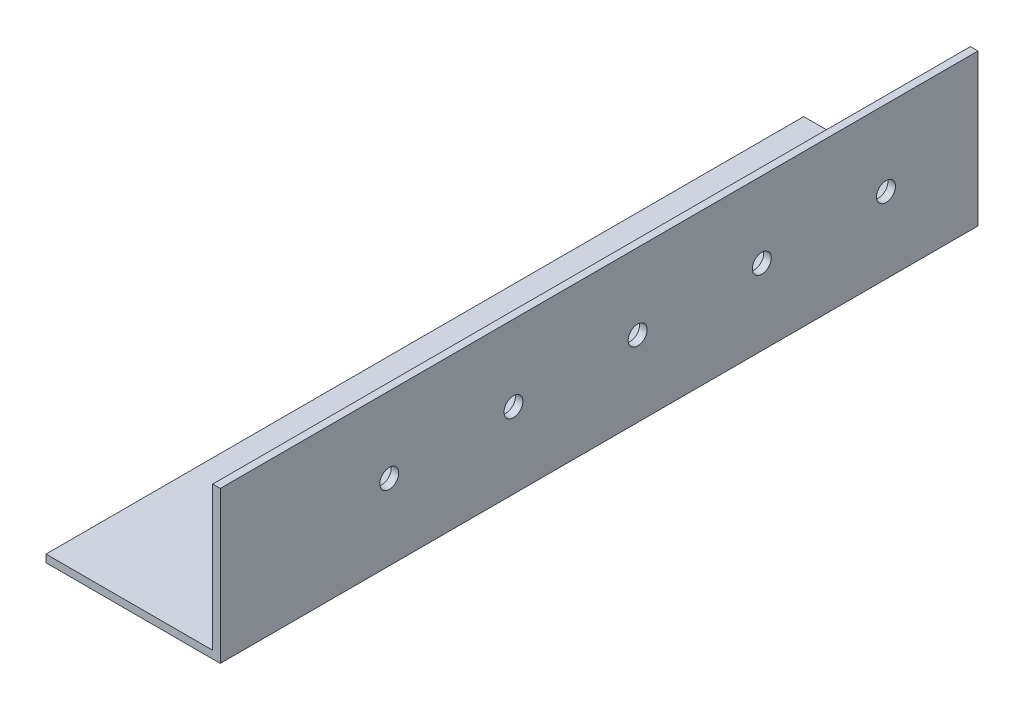
ISO-10303-21;
HEADER;
FILE_DESCRIPTION(('STEP AP214'),'2;1');
FILE_NAME('part.step','',(''),(''),'','','');
FILE_SCHEMA(('AUTOMOTIVE_DESIGN { 1 0 10303 214 1 1 1 1 }'));
ENDSEC;
DATA;
#1=APPLICATION_CONTEXT('core data for automotive mechanical design processes');
#2=APPLICATION_PROTOCOL_DEFINITION('international standard','automotive_design',2000,#1);
#3=PRODUCT_CONTEXT('',#1,'mechanical');
#4=PRODUCT('Part','Part','',(#3));
#5=PRODUCT_RELATED_PRODUCT_CATEGORY('part','',(#4));
#6=PRODUCT_DEFINITION_FORMATION('','',#4);
#7=PRODUCT_DEFINITION_CONTEXT('part definition',#1,'design');
#8=PRODUCT_DEFINITION('design','',#6,#7);
#9=PRODUCT_DEFINITION_SHAPE('','',#8);
#10=(LENGTH_UNIT() NAMED_UNIT(*) SI_UNIT(.MILLI.,.METRE.));
#11=(NAMED_UNIT(*) PLANE_ANGLE_UNIT() SI_UNIT($,.RADIAN.));
#12=(NAMED_UNIT(*) SI_UNIT($,.STERADIAN.) SOLID_ANGLE_UNIT());
#13=UNCERTAINTY_MEASURE_WITH_UNIT(LENGTH_MEASURE(1.E-05),#10,'distance_accuracy_value','');
#14=(GEOMETRIC_REPRESENTATION_CONTEXT(3) GLOBAL_UNCERTAINTY_ASSIGNED_CONTEXT((#13)) GLOBAL_UNIT_ASSIGNED_CONTEXT((#10,
#11,#12)) REPRESENTATION_CONTEXT('',''));
#15=CARTESIAN_POINT('',(0.,0.,0.));
#16=DIRECTION('',(0.,0.,1.));
#17=DIRECTION('',(1.,0.,0.));
#18=AXIS2_PLACEMENT_3D('',#15,#16,#17);
#19=CARTESIAN_POINT('',(0.,0.,-100.));
#20=DIRECTION('',(0.,0.,1.));
#21=DIRECTION('',(1.,0.,0.));
#22=AXIS2_PLACEMENT_3D('',#19,#20,#21);
#23=PLANE('',#22);
#24=DIRECTION('',(1.,0.,0.));
#25=VECTOR('',#24,1.);
#26=CARTESIAN_POINT('',(0.,-20.,-100.));
#27=LINE('',#26,#25);
#28=CARTESIAN_POINT('',(-19.,-20.,-100.));
#29=VERTEX_POINT('',#28);
#30=CARTESIAN_POINT('',(27.,-20.,-100.));
#31=VERTEX_POINT('',#30);
#32=EDGE_CURVE('E149',#29,#31,#27,.T.);
#33=ORIENTED_EDGE('',*,*,#32,.F.);
#34=DIRECTION('',(0.,1.,0.));
#35=VECTOR('',#34,1.);
#36=CARTESIAN_POINT('',(-19.,-20.,-100.));
#37=LINE('',#36,#35);
#38=CARTESIAN_POINT('',(-19.,-18.,-100.));
#39=VERTEX_POINT('',#38);
#40=EDGE_CURVE('E139',#29,#39,#37,.T.);
#41=ORIENTED_EDGE('',*,*,#40,.T.);
#42=DIRECTION('',(-1.,0.,0.));
#43=VECTOR('',#42,1.);
#44=CARTESIAN_POINT('',(0.,-18.,-100.));
#45=LINE('',#44,#43);
#46=CARTESIAN_POINT('',(25.,-18.,-100.));
#47=VERTEX_POINT('',#46);
#48=EDGE_CURVE('E124',#47,#39,#45,.T.);
#49=ORIENTED_EDGE('',*,*,#48,.F.);
#50=DIRECTION('',(0.,1.,0.));
#51=VECTOR('',#50,1.);
#52=CARTESIAN_POINT('',(25.,-18.,-100.));
#53=LINE('',#52,#51);
#54=CARTESIAN_POINT('',(25.,20.,-100.));
#55=VERTEX_POINT('',#54);
#56=EDGE_CURVE('E171',#47,#55,#53,.T.);
#57=ORIENTED_EDGE('',*,*,#56,.T.);
#58=DIRECTION('',(1.,0.,0.));
#59=VECTOR('',#58,1.);
#60=CARTESIAN_POINT('',(25.,20.,-100.));
#61=LINE('',#60,#59);
#62=CARTESIAN_POINT('',(27.,20.,-100.));
#63=VERTEX_POINT('',#62);
#64=EDGE_CURVE('E173',#55,#63,#61,.T.);
#65=ORIENTED_EDGE('',*,*,#64,.T.);
#66=DIRECTION('',(0.,-1.,0.));
#67=VECTOR('',#66,1.);
#68=CARTESIAN_POINT('',(27.,20.,-100.));
#69=LINE('',#68,#67);
#70=EDGE_CURVE('E155',#63,#31,#69,.T.);
#71=ORIENTED_EDGE('',*,*,#70,.T.);
#72=EDGE_LOOP('',(#33,#41,#49,#57,#65,#71));
#73=FACE_BOUND('',#72,.T.);
#74=ADVANCED_FACE('F77',(#73),#23,.F.);
#75=CARTESIAN_POINT('',(0.,-20.,100.));
#76=DIRECTION('',(0.,1.,0.));
#77=DIRECTION('',(-1.,0.,0.));
#78=AXIS2_PLACEMENT_3D('',#75,#76,#77);
#79=PLANE('',#78);
#80=DIRECTION('',(1.,0.,0.));
#81=VECTOR('',#80,1.);
#82=CARTESIAN_POINT('',(0.,-20.,100.));
#83=LINE('',#82,#81);
#84=CARTESIAN_POINT('',(-19.,-20.,100.));
#85=VERTEX_POINT('',#84);
#86=CARTESIAN_POINT('',(27.,-20.,100.));
#87=VERTEX_POINT('',#86);
#88=EDGE_CURVE('E86',#85,#87,#83,.T.);
#89=ORIENTED_EDGE('',*,*,#88,.F.);
#90=DIRECTION('',(0.,0.,1.));
#91=VECTOR('',#90,1.);
#92=CARTESIAN_POINT('',(-19.,-20.,-100.));
#93=LINE('',#92,#91);
#94=EDGE_CURVE('E94',#29,#85,#93,.T.);
#95=ORIENTED_EDGE('',*,*,#94,.F.);
#96=ORIENTED_EDGE('',*,*,#32,.T.);
#97=DIRECTION('',(0.,0.,-1.));
#98=VECTOR('',#97,1.);
#99=CARTESIAN_POINT('',(27.,-20.,100.));
#100=LINE('',#99,#98);
#101=EDGE_CURVE('E159',#87,#31,#100,.T.);
#102=ORIENTED_EDGE('',*,*,#101,.F.);
#103=EDGE_LOOP('',(#89,#95,#96,#102));
#104=FACE_BOUND('',#103,.T.);
#105=ADVANCED_FACE('F147',(#104),#79,.F.);
#106=CARTESIAN_POINT('',(0.,-18.,100.));
#107=DIRECTION('',(0.,-1.,0.));
#108=DIRECTION('',(1.,0.,0.));
#109=AXIS2_PLACEMENT_3D('',#106,#107,#108);
#110=PLANE('',#109);
#111=ORIENTED_EDGE('',*,*,#48,.T.);
#112=DIRECTION('',(0.,0.,1.));
#113=VECTOR('',#112,1.);
#114=CARTESIAN_POINT('',(-19.,-18.,100.));
#115=LINE('',#114,#113);
#116=CARTESIAN_POINT('',(-19.,-18.,100.));
#117=VERTEX_POINT('',#116);
#118=EDGE_CURVE('E141',#39,#117,#115,.T.);
#119=ORIENTED_EDGE('',*,*,#118,.T.);
#120=DIRECTION('',(-1.,0.,0.));
#121=VECTOR('',#120,1.);
#122=CARTESIAN_POINT('',(0.,-18.,100.));
#123=LINE('',#122,#121);
#124=CARTESIAN_POINT('',(25.,-18.,100.));
#125=VERTEX_POINT('',#124);
#126=EDGE_CURVE('E12',#125,#117,#123,.T.);
#127=ORIENTED_EDGE('',*,*,#126,.F.);
#128=DIRECTION('',(0.,0.,-1.));
#129=VECTOR('',#128,1.);
#130=CARTESIAN_POINT('',(25.,-18.,100.));
#131=LINE('',#130,#129);
#132=EDGE_CURVE('E156',#125,#47,#131,.T.);
#133=ORIENTED_EDGE('',*,*,#132,.T.);
#134=EDGE_LOOP('',(#111,#119,#127,#133));
#135=FACE_BOUND('',#134,.T.);
#136=ADVANCED_FACE('F233',(#135),#110,.F.);
#137=CARTESIAN_POINT('',(0.,0.,100.));
#138=DIRECTION('',(0.,0.,1.));
#139=DIRECTION('',(1.,0.,0.));
#140=AXIS2_PLACEMENT_3D('',#137,#138,#139);
#141=PLANE('',#140);
#142=DIRECTION('',(0.,1.,0.));
#143=VECTOR('',#142,1.);
#144=CARTESIAN_POINT('',(-19.,-20.,100.));
#145=LINE('',#144,#143);
#146=EDGE_CURVE('E143',#85,#117,#145,.T.);
#147=ORIENTED_EDGE('',*,*,#146,.F.);
#148=ORIENTED_EDGE('',*,*,#88,.T.);
#149=DIRECTION('',(0.,-1.,0.));
#150=VECTOR('',#149,1.);
#151=CARTESIAN_POINT('',(27.,20.,100.));
#152=LINE('',#151,#150);
#153=CARTESIAN_POINT('',(27.,20.,100.));
#154=VERTEX_POINT('',#153);
#155=EDGE_CURVE('E168',#154,#87,#152,.T.);
#156=ORIENTED_EDGE('',*,*,#155,.F.);
#157=DIRECTION('',(1.,0.,0.));
#158=VECTOR('',#157,1.);
#159=CARTESIAN_POINT('',(25.,20.,100.));
#160=LINE('',#159,#158);
#161=CARTESIAN_POINT('',(25.,20.,100.));
#162=VERTEX_POINT('',#161);
#163=EDGE_CURVE('E166',#162,#154,#160,.T.);
#164=ORIENTED_EDGE('',*,*,#163,.F.);
#165=DIRECTION('',(0.,1.,0.));
#166=VECTOR('',#165,1.);
#167=CARTESIAN_POINT('',(25.,-18.,100.));
#168=LINE('',#167,#166);
#169=EDGE_CURVE('E163',#125,#162,#168,.T.);
#170=ORIENTED_EDGE('',*,*,#169,.F.);
#171=ORIENTED_EDGE('',*,*,#126,.T.);
#172=EDGE_LOOP('',(#147,#148,#156,#164,#170,#171));
#173=FACE_BOUND('',#172,.T.);
#174=ADVANCED_FACE('F216',(#173),#141,.T.);
#175=CARTESIAN_POINT('',(27.,20.,100.));
#176=DIRECTION('',(1.,0.,0.));
#177=DIRECTION('',(0.,1.,0.));
#178=AXIS2_PLACEMENT_3D('',#175,#176,#177);
#179=PLANE('',#178);
#180=CARTESIAN_POINT('',(27.,0.,55.4));
#181=DIRECTION('',(1.,0.,0.));
#182=DIRECTION('',(0.,1.,0.));
#183=AXIS2_PLACEMENT_3D('',#180,#181,#182);
#184=CIRCLE('',#183,2.5);
#185=CARTESIAN_POINT('',(27.,2.5,55.4));
#186=VERTEX_POINT('',#185);
#187=EDGE_CURVE('E184',#186,#186,#184,.T.);
#188=ORIENTED_EDGE('',*,*,#187,.F.);
#189=EDGE_LOOP('',(#188));
#190=FACE_BOUND('',#189,.T.);
#191=CARTESIAN_POINT('',(27.,0.,22.62));
#192=DIRECTION('',(1.,0.,0.));
#193=DIRECTION('',(0.,1.,0.));
#194=AXIS2_PLACEMENT_3D('',#191,#192,#193);
#195=CIRCLE('',#194,2.5);
#196=CARTESIAN_POINT('',(27.,2.5,22.62));
#197=VERTEX_POINT('',#196);
#198=EDGE_CURVE('E227',#197,#197,#195,.T.);
#199=ORIENTED_EDGE('',*,*,#198,.F.);
#200=EDGE_LOOP('',(#199));
#201=FACE_BOUND('',#200,.T.);
#202=CARTESIAN_POINT('',(27.,0.,-10.16));
#203=DIRECTION('',(1.,0.,0.));
#204=DIRECTION('',(0.,1.,0.));
#205=AXIS2_PLACEMENT_3D('',#202,#203,#204);
#206=CIRCLE('',#205,2.5);
#207=CARTESIAN_POINT('',(27.,2.50000000000001,-10.16));
#208=VERTEX_POINT('',#207);
#209=EDGE_CURVE('E224',#208,#208,#206,.T.);
#210=ORIENTED_EDGE('',*,*,#209,.F.);
#211=EDGE_LOOP('',(#210));
#212=FACE_BOUND('',#211,.T.);
#213=CARTESIAN_POINT('',(27.,0.,-42.94));
#214=DIRECTION('',(1.,0.,0.));
#215=DIRECTION('',(0.,1.,0.));
#216=AXIS2_PLACEMENT_3D('',#213,#214,#215);
#217=CIRCLE('',#216,2.5);
#218=CARTESIAN_POINT('',(27.,2.50000000000001,-42.94));
#219=VERTEX_POINT('',#218);
#220=EDGE_CURVE('E221',#219,#219,#217,.T.);
#221=ORIENTED_EDGE('',*,*,#220,.F.);
#222=EDGE_LOOP('',(#221));
#223=FACE_BOUND('',#222,.T.);
#224=CARTESIAN_POINT('',(27.,0.,-75.72));
#225=DIRECTION('',(1.,0.,0.));
#226=DIRECTION('',(0.,1.,0.));
#227=AXIS2_PLACEMENT_3D('',#224,#225,#226);
#228=CIRCLE('',#227,2.49999999999999);
#229=CARTESIAN_POINT('',(27.,2.5,-75.72));
#230=VERTEX_POINT('',#229);
#231=EDGE_CURVE('E218',#230,#230,#228,.T.);
#232=ORIENTED_EDGE('',*,*,#231,.F.);
#233=EDGE_LOOP('',(#232));
#234=FACE_BOUND('',#233,.T.);
#235=ORIENTED_EDGE('',*,*,#70,.F.);
#236=DIRECTION('',(0.,0.,-1.));
#237=VECTOR('',#236,1.);
#238=CARTESIAN_POINT('',(27.,20.,100.));
#239=LINE('',#238,#237);
#240=EDGE_CURVE('E177',#154,#63,#239,.T.);
#241=ORIENTED_EDGE('',*,*,#240,.F.);
#242=ORIENTED_EDGE('',*,*,#155,.T.);
#243=ORIENTED_EDGE('',*,*,#101,.T.);
#244=EDGE_LOOP('',(#235,#241,#242,#243));
#245=FACE_BOUND('',#244,.T.);
#246=ADVANCED_FACE('F214',(#190,#201,#212,#223,#234,#245),#179,.T.);
#247=CARTESIAN_POINT('',(25.,20.,100.));
#248=DIRECTION('',(0.,1.,0.));
#249=DIRECTION('',(-1.,0.,0.));
#250=AXIS2_PLACEMENT_3D('',#247,#248,#249);
#251=PLANE('',#250);
#252=ORIENTED_EDGE('',*,*,#64,.F.);
#253=DIRECTION('',(0.,0.,-1.));
#254=VECTOR('',#253,1.);
#255=CARTESIAN_POINT('',(25.,20.,100.));
#256=LINE('',#255,#254);
#257=EDGE_CURVE('E130',#162,#55,#256,.T.);
#258=ORIENTED_EDGE('',*,*,#257,.F.);
#259=ORIENTED_EDGE('',*,*,#163,.T.);
#260=ORIENTED_EDGE('',*,*,#240,.T.);
#261=EDGE_LOOP('',(#252,#258,#259,#260));
#262=FACE_BOUND('',#261,.T.);
#263=ADVANCED_FACE('F202',(#262),#251,.T.);
#264=CARTESIAN_POINT('',(25.,-18.,100.));
#265=DIRECTION('',(-1.,0.,0.));
#266=DIRECTION('',(0.,-1.,0.));
#267=AXIS2_PLACEMENT_3D('',#264,#265,#266);
#268=PLANE('',#267);
#269=CARTESIAN_POINT('',(25.,0.,55.4));
#270=DIRECTION('',(-1.,0.,0.));
#271=DIRECTION('',(0.,-1.,0.));
#272=AXIS2_PLACEMENT_3D('',#269,#270,#271);
#273=CIRCLE('',#272,2.5);
#274=CARTESIAN_POINT('',(25.,-2.5,55.4));
#275=VERTEX_POINT('',#274);
#276=EDGE_CURVE('E81',#275,#275,#273,.T.);
#277=ORIENTED_EDGE('',*,*,#276,.F.);
#278=EDGE_LOOP('',(#277));
#279=FACE_BOUND('',#278,.T.);
#280=CARTESIAN_POINT('',(25.,0.,22.62));
#281=DIRECTION('',(-1.,0.,0.));
#282=DIRECTION('',(0.,-1.,0.));
#283=AXIS2_PLACEMENT_3D('',#280,#281,#282);
#284=CIRCLE('',#283,2.5);
#285=CARTESIAN_POINT('',(25.,-2.49999999999999,22.62));
#286=VERTEX_POINT('',#285);
#287=EDGE_CURVE('E189',#286,#286,#284,.T.);
#288=ORIENTED_EDGE('',*,*,#287,.F.);
#289=EDGE_LOOP('',(#288));
#290=FACE_BOUND('',#289,.T.);
#291=CARTESIAN_POINT('',(25.,0.,-10.16));
#292=DIRECTION('',(-1.,0.,0.));
#293=DIRECTION('',(0.,-1.,0.));
#294=AXIS2_PLACEMENT_3D('',#291,#292,#293);
#295=CIRCLE('',#294,2.5);
#296=CARTESIAN_POINT('',(25.,-2.49999999999999,-10.16));
#297=VERTEX_POINT('',#296);
#298=EDGE_CURVE('E187',#297,#297,#295,.T.);
#299=ORIENTED_EDGE('',*,*,#298,.F.);
#300=EDGE_LOOP('',(#299));
#301=FACE_BOUND('',#300,.T.);
#302=CARTESIAN_POINT('',(25.,0.,-42.94));
#303=DIRECTION('',(-1.,0.,0.));
#304=DIRECTION('',(0.,-1.,0.));
#305=AXIS2_PLACEMENT_3D('',#302,#303,#304);
#306=CIRCLE('',#305,2.5);
#307=CARTESIAN_POINT('',(25.,-2.5,-42.94));
#308=VERTEX_POINT('',#307);
#309=EDGE_CURVE('E183',#308,#308,#306,.T.);
#310=ORIENTED_EDGE('',*,*,#309,.F.);
#311=EDGE_LOOP('',(#310));
#312=FACE_BOUND('',#311,.T.);
#313=CARTESIAN_POINT('',(25.,0.,-75.72));
#314=DIRECTION('',(-1.,0.,0.));
#315=DIRECTION('',(0.,-1.,0.));
#316=AXIS2_PLACEMENT_3D('',#313,#314,#315);
#317=CIRCLE('',#316,2.49999999999999);
#318=CARTESIAN_POINT('',(25.,-2.49999999999999,-75.72));
#319=VERTEX_POINT('',#318);
#320=EDGE_CURVE('E180',#319,#319,#317,.T.);
#321=ORIENTED_EDGE('',*,*,#320,.F.);
#322=EDGE_LOOP('',(#321));
#323=FACE_BOUND('',#322,.T.);
#324=ORIENTED_EDGE('',*,*,#56,.F.);
#325=ORIENTED_EDGE('',*,*,#132,.F.);
#326=ORIENTED_EDGE('',*,*,#169,.T.);
#327=ORIENTED_EDGE('',*,*,#257,.T.);
#328=EDGE_LOOP('',(#324,#325,#326,#327));
#329=FACE_BOUND('',#328,.T.);
#330=ADVANCED_FACE('F79',(#279,#290,#301,#312,#323,#329),#268,.T.);
#331=CARTESIAN_POINT('',(17.,0.,-75.72));
#332=DIRECTION('',(1.,0.,0.));
#333=DIRECTION('',(0.,1.,0.));
#334=AXIS2_PLACEMENT_3D('',#331,#332,#333);
#335=CYLINDRICAL_SURFACE('',#334,2.49999999999999);
#336=ORIENTED_EDGE('',*,*,#320,.T.);
#337=EDGE_LOOP('',(#336));
#338=FACE_BOUND('',#337,.T.);
#339=ORIENTED_EDGE('',*,*,#231,.T.);
#340=EDGE_LOOP('',(#339));
#341=FACE_BOUND('',#340,.T.);
#342=ADVANCED_FACE('F201',(#338,#341),#335,.F.);
#343=CARTESIAN_POINT('',(17.,0.,-42.94));
#344=DIRECTION('',(1.,0.,0.));
#345=DIRECTION('',(0.,1.,0.));
#346=AXIS2_PLACEMENT_3D('',#343,#344,#345);
#347=CYLINDRICAL_SURFACE('',#346,2.5);
#348=ORIENTED_EDGE('',*,*,#309,.T.);
#349=EDGE_LOOP('',(#348));
#350=FACE_BOUND('',#349,.T.);
#351=ORIENTED_EDGE('',*,*,#220,.T.);
#352=EDGE_LOOP('',(#351));
#353=FACE_BOUND('',#352,.T.);
#354=ADVANCED_FACE('F249',(#350,#353),#347,.F.);
#355=CARTESIAN_POINT('',(17.,0.,-10.16));
#356=DIRECTION('',(1.,0.,0.));
#357=DIRECTION('',(0.,1.,0.));
#358=AXIS2_PLACEMENT_3D('',#355,#356,#357);
#359=CYLINDRICAL_SURFACE('',#358,2.5);
#360=ORIENTED_EDGE('',*,*,#298,.T.);
#361=EDGE_LOOP('',(#360));
#362=FACE_BOUND('',#361,.T.);
#363=ORIENTED_EDGE('',*,*,#209,.T.);
#364=EDGE_LOOP('',(#363));
#365=FACE_BOUND('',#364,.T.);
#366=ADVANCED_FACE('F253',(#362,#365),#359,.F.);
#367=CARTESIAN_POINT('',(17.,0.,22.62));
#368=DIRECTION('',(1.,0.,0.));
#369=DIRECTION('',(0.,1.,0.));
#370=AXIS2_PLACEMENT_3D('',#367,#368,#369);
#371=CYLINDRICAL_SURFACE('',#370,2.5);
#372=ORIENTED_EDGE('',*,*,#287,.T.);
#373=EDGE_LOOP('',(#372));
#374=FACE_BOUND('',#373,.T.);
#375=ORIENTED_EDGE('',*,*,#198,.T.);
#376=EDGE_LOOP('',(#375));
#377=FACE_BOUND('',#376,.T.);
#378=ADVANCED_FACE('F257',(#374,#377),#371,.F.);
#379=CARTESIAN_POINT('',(17.,0.,55.4));
#380=DIRECTION('',(1.,0.,0.));
#381=DIRECTION('',(0.,1.,0.));
#382=AXIS2_PLACEMENT_3D('',#379,#380,#381);
#383=CYLINDRICAL_SURFACE('',#382,2.5);
#384=ORIENTED_EDGE('',*,*,#276,.T.);
#385=EDGE_LOOP('',(#384));
#386=FACE_BOUND('',#385,.T.);
#387=ORIENTED_EDGE('',*,*,#187,.T.);
#388=EDGE_LOOP('',(#387));
#389=FACE_BOUND('',#388,.T.);
#390=ADVANCED_FACE('F196',(#386,#389),#383,.F.);
#391=CARTESIAN_POINT('',(-19.,-20.,-100.));
#392=DIRECTION('',(1.,0.,0.));
#393=DIRECTION('',(0.,0.,-1.));
#394=AXIS2_PLACEMENT_3D('',#391,#392,#393);
#395=PLANE('',#394);
#396=ORIENTED_EDGE('',*,*,#40,.F.);
#397=ORIENTED_EDGE('',*,*,#94,.T.);
#398=ORIENTED_EDGE('',*,*,#146,.T.);
#399=ORIENTED_EDGE('',*,*,#118,.F.);
#400=EDGE_LOOP('',(#396,#397,#398,#399));
#401=FACE_BOUND('',#400,.T.);
#402=ADVANCED_FACE('F140',(#401),#395,.F.);
#403=CLOSED_SHELL('',(#74,#105,#136,#174,#246,#263,#330,#342,#354,#366,#378,#390,#402));
#404=MANIFOLD_SOLID_BREP('B2',#403);
#405=ADVANCED_BREP_SHAPE_REPRESENTATION('',(#18,#404),#14);
#406=SHAPE_DEFINITION_REPRESENTATION(#9,#405);
ENDSEC;
END-ISO-10303-21;
